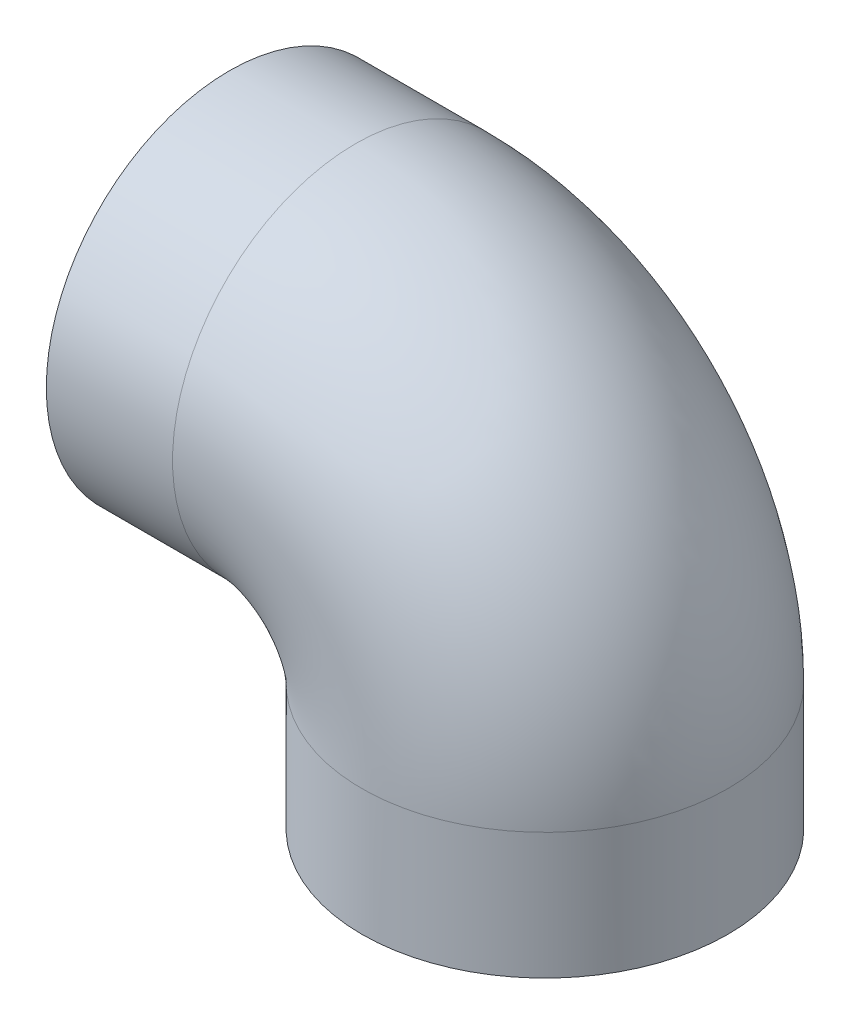
ISO-10303-21;
HEADER;
FILE_DESCRIPTION(('STEP AP214'),'2;1');
FILE_NAME('part.step','',(''),(''),'','','');
FILE_SCHEMA(('AUTOMOTIVE_DESIGN { 1 0 10303 214 1 1 1 1 }'));
ENDSEC;
DATA;
#1=APPLICATION_CONTEXT('core data for automotive mechanical design processes');
#2=APPLICATION_PROTOCOL_DEFINITION('international standard','automotive_design',2000,#1);
#3=PRODUCT_CONTEXT('',#1,'mechanical');
#4=PRODUCT('Part','Part','',(#3));
#5=PRODUCT_RELATED_PRODUCT_CATEGORY('part','',(#4));
#6=PRODUCT_DEFINITION_FORMATION('','',#4);
#7=PRODUCT_DEFINITION_CONTEXT('part definition',#1,'design');
#8=PRODUCT_DEFINITION('design','',#6,#7);
#9=PRODUCT_DEFINITION_SHAPE('','',#8);
#10=(LENGTH_UNIT() NAMED_UNIT(*) SI_UNIT(.MILLI.,.METRE.));
#11=(NAMED_UNIT(*) PLANE_ANGLE_UNIT() SI_UNIT($,.RADIAN.));
#12=(NAMED_UNIT(*) SI_UNIT($,.STERADIAN.) SOLID_ANGLE_UNIT());
#13=UNCERTAINTY_MEASURE_WITH_UNIT(LENGTH_MEASURE(1.E-05),#10,'distance_accuracy_value','');
#14=(GEOMETRIC_REPRESENTATION_CONTEXT(3) GLOBAL_UNCERTAINTY_ASSIGNED_CONTEXT((#13)) GLOBAL_UNIT_ASSIGNED_CONTEXT((#10,
#11,#12)) REPRESENTATION_CONTEXT('',''));
#15=CARTESIAN_POINT('',(0.,0.,0.));
#16=DIRECTION('',(0.,0.,1.));
#17=DIRECTION('',(1.,0.,0.));
#18=AXIS2_PLACEMENT_3D('',#15,#16,#17);
#19=CARTESIAN_POINT('',(30.,0.,0.));
#20=DIRECTION('',(0.,-1.,0.));
#21=DIRECTION('',(1.,0.,0.));
#22=AXIS2_PLACEMENT_3D('',#19,#20,#21);
#23=CYLINDRICAL_SURFACE('',#22,25.);
#24=CARTESIAN_POINT('',(30.,0.,0.));
#25=DIRECTION('',(0.,1.,0.));
#26=DIRECTION('',(0.,0.,1.));
#27=AXIS2_PLACEMENT_3D('',#24,#25,#26);
#28=CIRCLE('',#27,25.);
#29=CARTESIAN_POINT('',(55.,0.,0.));
#30=VERTEX_POINT('',#29);
#31=EDGE_CURVE('E10',#30,#30,#28,.F.);
#32=ORIENTED_EDGE('',*,*,#31,.F.);
#33=EDGE_LOOP('',(#32));
#34=FACE_BOUND('',#33,.T.);
#35=CARTESIAN_POINT('',(30.,-15.,0.));
#36=DIRECTION('',(0.,-1.,0.));
#37=DIRECTION('',(0.,0.,-1.));
#38=AXIS2_PLACEMENT_3D('',#35,#36,#37);
#39=CIRCLE('',#38,25.);
#40=CARTESIAN_POINT('',(30.,-15.,-25.));
#41=VERTEX_POINT('',#40);
#42=EDGE_CURVE('E76',#41,#41,#39,.T.);
#43=ORIENTED_EDGE('',*,*,#42,.T.);
#44=EDGE_LOOP('',(#43));
#45=FACE_BOUND('',#44,.T.);
#46=ADVANCED_FACE('F35',(#34,#45),#23,.F.);
#47=CARTESIAN_POINT('',(-20.,30.,0.));
#48=DIRECTION('',(1.,0.,0.));
#49=DIRECTION('',(0.,1.,0.));
#50=AXIS2_PLACEMENT_3D('',#47,#48,#49);
#51=CYLINDRICAL_SURFACE('',#50,25.);
#52=CARTESIAN_POINT('',(0.,30.,0.));
#53=DIRECTION('',(-1.,0.,0.));
#54=DIRECTION('',(0.,0.,1.));
#55=AXIS2_PLACEMENT_3D('',#52,#53,#54);
#56=CIRCLE('',#55,25.);
#57=CARTESIAN_POINT('',(0.,55.,0.));
#58=VERTEX_POINT('',#57);
#59=EDGE_CURVE('E43',#58,#58,#56,.F.);
#60=ORIENTED_EDGE('',*,*,#59,.T.);
#61=EDGE_LOOP('',(#60));
#62=FACE_BOUND('',#61,.T.);
#63=CARTESIAN_POINT('',(-15.,30.,0.));
#64=DIRECTION('',(-1.,0.,0.));
#65=DIRECTION('',(0.,0.,1.));
#66=AXIS2_PLACEMENT_3D('',#63,#64,#65);
#67=CIRCLE('',#66,25.);
#68=CARTESIAN_POINT('',(-15.,30.,25.));
#69=VERTEX_POINT('',#68);
#70=EDGE_CURVE('E68',#69,#69,#67,.T.);
#71=ORIENTED_EDGE('',*,*,#70,.T.);
#72=EDGE_LOOP('',(#71));
#73=FACE_BOUND('',#72,.T.);
#74=ADVANCED_FACE('F115',(#62,#73),#51,.F.);
#75=CARTESIAN_POINT('',(-20.,30.,0.));
#76=DIRECTION('',(1.,0.,0.));
#77=DIRECTION('',(0.,1.,0.));
#78=AXIS2_PLACEMENT_3D('',#75,#76,#77);
#79=CYLINDRICAL_SURFACE('',#78,29.);
#80=CARTESIAN_POINT('',(0.,30.,0.));
#81=DIRECTION('',(-1.,0.,0.));
#82=DIRECTION('',(0.,0.,1.));
#83=AXIS2_PLACEMENT_3D('',#80,#81,#82);
#84=CIRCLE('',#83,29.);
#85=CARTESIAN_POINT('',(0.,59.,0.));
#86=VERTEX_POINT('',#85);
#87=EDGE_CURVE('E56',#86,#86,#84,.T.);
#88=ORIENTED_EDGE('',*,*,#87,.T.);
#89=EDGE_LOOP('',(#88));
#90=FACE_BOUND('',#89,.T.);
#91=CARTESIAN_POINT('',(-20.,30.,0.));
#92=DIRECTION('',(-1.,0.,0.));
#93=DIRECTION('',(0.,0.,1.));
#94=AXIS2_PLACEMENT_3D('',#91,#92,#93);
#95=CIRCLE('',#94,29.);
#96=CARTESIAN_POINT('',(-20.,30.,29.));
#97=VERTEX_POINT('',#96);
#98=EDGE_CURVE('E54',#97,#97,#95,.T.);
#99=ORIENTED_EDGE('',*,*,#98,.F.);
#100=EDGE_LOOP('',(#99));
#101=FACE_BOUND('',#100,.T.);
#102=ADVANCED_FACE('F111',(#90,#101),#79,.T.);
#103=CARTESIAN_POINT('',(0.,0.,0.));
#104=DIRECTION('',(0.,0.,-1.));
#105=DIRECTION('',(-1.,0.,0.));
#106=AXIS2_PLACEMENT_3D('',#103,#104,#105);
#107=TOROIDAL_SURFACE('',#106,30.,29.);
#108=CARTESIAN_POINT('',(30.,0.,0.));
#109=DIRECTION('',(0.,1.,0.));
#110=DIRECTION('',(0.,0.,1.));
#111=AXIS2_PLACEMENT_3D('',#108,#109,#110);
#112=CIRCLE('',#111,29.);
#113=CARTESIAN_POINT('',(59.,0.,0.));
#114=VERTEX_POINT('',#113);
#115=EDGE_CURVE('E39',#114,#114,#112,.T.);
#116=CARTESIAN_POINT('',(0.,0.,0.));
#117=DIRECTION('',(0.,0.,-1.));
#118=DIRECTION('',(-1.,0.,0.));
#119=AXIS2_PLACEMENT_3D('',#116,#117,#118);
#120=CIRCLE('',#119,59.);
#121=EDGE_CURVE('',#86,#114,#120,.T.);
#122=ORIENTED_EDGE('',*,*,#87,.F.);
#123=ORIENTED_EDGE('',*,*,#115,.T.);
#124=ORIENTED_EDGE('',*,*,#121,.T.);
#125=ORIENTED_EDGE('',*,*,#121,.F.);
#126=EDGE_LOOP('',(#122,#124,#123,#125));
#127=FACE_BOUND('',#126,.T.);
#128=ADVANCED_FACE('F106',(#127),#107,.T.);
#129=CARTESIAN_POINT('',(30.,0.,0.));
#130=DIRECTION('',(0.,-1.,0.));
#131=DIRECTION('',(1.,0.,0.));
#132=AXIS2_PLACEMENT_3D('',#129,#130,#131);
#133=CYLINDRICAL_SURFACE('',#132,29.);
#134=CARTESIAN_POINT('',(30.,-20.,0.));
#135=DIRECTION('',(0.,1.,0.));
#136=DIRECTION('',(0.,0.,1.));
#137=AXIS2_PLACEMENT_3D('',#134,#135,#136);
#138=CIRCLE('',#137,29.);
#139=CARTESIAN_POINT('',(30.,-20.,29.));
#140=VERTEX_POINT('',#139);
#141=EDGE_CURVE('E48',#140,#140,#138,.T.);
#142=ORIENTED_EDGE('',*,*,#141,.T.);
#143=EDGE_LOOP('',(#142));
#144=FACE_BOUND('',#143,.T.);
#145=ORIENTED_EDGE('',*,*,#115,.F.);
#146=EDGE_LOOP('',(#145));
#147=FACE_BOUND('',#146,.T.);
#148=ADVANCED_FACE('F37',(#144,#147),#133,.T.);
#149=CARTESIAN_POINT('',(-20.,30.,0.));
#150=DIRECTION('',(-1.,0.,0.));
#151=DIRECTION('',(0.,0.,1.));
#152=AXIS2_PLACEMENT_3D('',#149,#150,#151);
#153=PLANE('',#152);
#154=CARTESIAN_POINT('',(-20.,30.,0.));
#155=DIRECTION('',(-1.,0.,0.));
#156=DIRECTION('',(0.,0.,1.));
#157=AXIS2_PLACEMENT_3D('',#154,#155,#156);
#158=CIRCLE('',#157,27.);
#159=CARTESIAN_POINT('',(-20.,30.,27.));
#160=VERTEX_POINT('',#159);
#161=EDGE_CURVE('E63',#160,#160,#158,.T.);
#162=ORIENTED_EDGE('',*,*,#161,.F.);
#163=EDGE_LOOP('',(#162));
#164=FACE_BOUND('',#163,.T.);
#165=ORIENTED_EDGE('',*,*,#98,.T.);
#166=EDGE_LOOP('',(#165));
#167=FACE_BOUND('',#166,.T.);
#168=ADVANCED_FACE('F100',(#164,#167),#153,.T.);
#169=CARTESIAN_POINT('',(30.,-20.,0.));
#170=DIRECTION('',(0.,1.,0.));
#171=DIRECTION('',(0.,0.,1.));
#172=AXIS2_PLACEMENT_3D('',#169,#170,#171);
#173=PLANE('',#172);
#174=CARTESIAN_POINT('',(30.,-20.,0.));
#175=DIRECTION('',(0.,-1.,0.));
#176=DIRECTION('',(0.,0.,-1.));
#177=AXIS2_PLACEMENT_3D('',#174,#175,#176);
#178=CIRCLE('',#177,27.);
#179=CARTESIAN_POINT('',(30.,-20.,-27.));
#180=VERTEX_POINT('',#179);
#181=EDGE_CURVE('E73',#180,#180,#178,.T.);
#182=ORIENTED_EDGE('',*,*,#181,.F.);
#183=EDGE_LOOP('',(#182));
#184=FACE_BOUND('',#183,.T.);
#185=ORIENTED_EDGE('',*,*,#141,.F.);
#186=EDGE_LOOP('',(#185));
#187=FACE_BOUND('',#186,.T.);
#188=ADVANCED_FACE('F96',(#184,#187),#173,.F.);
#189=CARTESIAN_POINT('',(0.,0.,0.));
#190=DIRECTION('',(0.,0.,-1.));
#191=DIRECTION('',(-1.,0.,0.));
#192=AXIS2_PLACEMENT_3D('',#189,#190,#191);
#193=TOROIDAL_SURFACE('',#192,30.,25.);
#194=CARTESIAN_POINT('',(0.,0.,0.));
#195=DIRECTION('',(0.,0.,-1.));
#196=DIRECTION('',(-1.,0.,0.));
#197=AXIS2_PLACEMENT_3D('',#194,#195,#196);
#198=CIRCLE('',#197,55.);
#199=EDGE_CURVE('',#58,#30,#198,.T.);
#200=ORIENTED_EDGE('',*,*,#59,.F.);
#201=ORIENTED_EDGE('',*,*,#31,.T.);
#202=ORIENTED_EDGE('',*,*,#199,.T.);
#203=ORIENTED_EDGE('',*,*,#199,.F.);
#204=EDGE_LOOP('',(#200,#202,#201,#203));
#205=FACE_BOUND('',#204,.T.);
#206=ADVANCED_FACE('F99',(#205),#193,.F.);
#207=CARTESIAN_POINT('',(-15.,30.,0.));
#208=DIRECTION('',(-1.,0.,0.));
#209=DIRECTION('',(0.,0.,1.));
#210=AXIS2_PLACEMENT_3D('',#207,#208,#209);
#211=CYLINDRICAL_SURFACE('',#210,27.);
#212=CARTESIAN_POINT('',(-15.,30.,0.));
#213=DIRECTION('',(-1.,0.,0.));
#214=DIRECTION('',(0.,0.,1.));
#215=AXIS2_PLACEMENT_3D('',#212,#213,#214);
#216=CIRCLE('',#215,27.);
#217=CARTESIAN_POINT('',(-15.,30.,27.));
#218=VERTEX_POINT('',#217);
#219=EDGE_CURVE('E58',#218,#218,#216,.T.);
#220=ORIENTED_EDGE('',*,*,#219,.F.);
#221=EDGE_LOOP('',(#220));
#222=FACE_BOUND('',#221,.T.);
#223=ORIENTED_EDGE('',*,*,#161,.T.);
#224=EDGE_LOOP('',(#223));
#225=FACE_BOUND('',#224,.T.);
#226=ADVANCED_FACE('F117',(#222,#225),#211,.F.);
#227=CARTESIAN_POINT('',(-15.,30.,0.));
#228=DIRECTION('',(-1.,0.,0.));
#229=DIRECTION('',(0.,0.,1.));
#230=AXIS2_PLACEMENT_3D('',#227,#228,#229);
#231=PLANE('',#230);
#232=ORIENTED_EDGE('',*,*,#70,.F.);
#233=EDGE_LOOP('',(#232));
#234=FACE_BOUND('',#233,.T.);
#235=ORIENTED_EDGE('',*,*,#219,.T.);
#236=EDGE_LOOP('',(#235));
#237=FACE_BOUND('',#236,.T.);
#238=ADVANCED_FACE('F92',(#234,#237),#231,.T.);
#239=CARTESIAN_POINT('',(30.,-15.,0.));
#240=DIRECTION('',(0.,-1.,0.));
#241=DIRECTION('',(0.,0.,-1.));
#242=AXIS2_PLACEMENT_3D('',#239,#240,#241);
#243=CYLINDRICAL_SURFACE('',#242,27.);
#244=CARTESIAN_POINT('',(30.,-15.,0.));
#245=DIRECTION('',(0.,-1.,0.));
#246=DIRECTION('',(0.,0.,-1.));
#247=AXIS2_PLACEMENT_3D('',#244,#245,#246);
#248=CIRCLE('',#247,27.);
#249=CARTESIAN_POINT('',(30.,-15.,-27.));
#250=VERTEX_POINT('',#249);
#251=EDGE_CURVE('E72',#250,#250,#248,.T.);
#252=ORIENTED_EDGE('',*,*,#251,.F.);
#253=EDGE_LOOP('',(#252));
#254=FACE_BOUND('',#253,.T.);
#255=ORIENTED_EDGE('',*,*,#181,.T.);
#256=EDGE_LOOP('',(#255));
#257=FACE_BOUND('',#256,.T.);
#258=ADVANCED_FACE('F86',(#254,#257),#243,.F.);
#259=CARTESIAN_POINT('',(30.,-15.,0.));
#260=DIRECTION('',(0.,-1.,0.));
#261=DIRECTION('',(0.,0.,-1.));
#262=AXIS2_PLACEMENT_3D('',#259,#260,#261);
#263=PLANE('',#262);
#264=ORIENTED_EDGE('',*,*,#42,.F.);
#265=EDGE_LOOP('',(#264));
#266=FACE_BOUND('',#265,.T.);
#267=ORIENTED_EDGE('',*,*,#251,.T.);
#268=EDGE_LOOP('',(#267));
#269=FACE_BOUND('',#268,.T.);
#270=ADVANCED_FACE('F83',(#266,#269),#263,.T.);
#271=CLOSED_SHELL('',(#46,#74,#102,#128,#148,#168,#188,#206,#226,#238,#258,#270));
#272=MANIFOLD_SOLID_BREP('B2',#271);
#273=ADVANCED_BREP_SHAPE_REPRESENTATION('',(#18,#272),#14);
#274=SHAPE_DEFINITION_REPRESENTATION(#9,#273);
ENDSEC;
END-ISO-10303-21;
